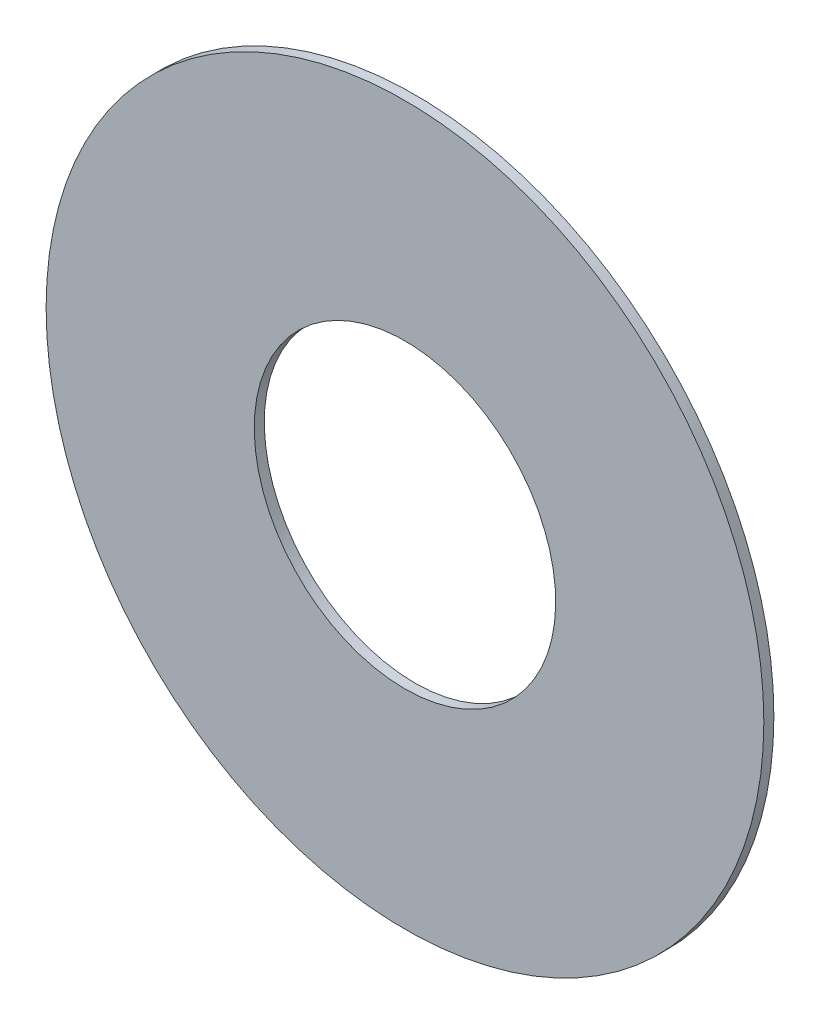
ISO-10303-21;
HEADER;
FILE_DESCRIPTION(('STEP AP214'),'2;1');
FILE_NAME('part.step','',(''),(''),'','','');
FILE_SCHEMA(('AUTOMOTIVE_DESIGN { 1 0 10303 214 1 1 1 1 }'));
ENDSEC;
DATA;
#1=APPLICATION_CONTEXT('core data for automotive mechanical design processes');
#2=APPLICATION_PROTOCOL_DEFINITION('international standard','automotive_design',2000,#1);
#3=PRODUCT_CONTEXT('',#1,'mechanical');
#4=PRODUCT('Part','Part','',(#3));
#5=PRODUCT_RELATED_PRODUCT_CATEGORY('part','',(#4));
#6=PRODUCT_DEFINITION_FORMATION('','',#4);
#7=PRODUCT_DEFINITION_CONTEXT('part definition',#1,'design');
#8=PRODUCT_DEFINITION('design','',#6,#7);
#9=PRODUCT_DEFINITION_SHAPE('','',#8);
#10=(LENGTH_UNIT() NAMED_UNIT(*) SI_UNIT(.MILLI.,.METRE.));
#11=(NAMED_UNIT(*) PLANE_ANGLE_UNIT() SI_UNIT($,.RADIAN.));
#12=(NAMED_UNIT(*) SI_UNIT($,.STERADIAN.) SOLID_ANGLE_UNIT());
#13=UNCERTAINTY_MEASURE_WITH_UNIT(LENGTH_MEASURE(1.E-05),#10,'distance_accuracy_value','');
#14=(GEOMETRIC_REPRESENTATION_CONTEXT(3) GLOBAL_UNCERTAINTY_ASSIGNED_CONTEXT((#13)) GLOBAL_UNIT_ASSIGNED_CONTEXT((#10,
#11,#12)) REPRESENTATION_CONTEXT('',''));
#15=CARTESIAN_POINT('',(0.,0.,0.));
#16=DIRECTION('',(0.,0.,1.));
#17=DIRECTION('',(1.,0.,0.));
#18=AXIS2_PLACEMENT_3D('',#15,#16,#17);
#19=CARTESIAN_POINT('',(154.002,-113.984,-0.045));
#20=DIRECTION('',(0.,0.,-1.));
#21=DIRECTION('',(0.,-1.,0.));
#22=AXIS2_PLACEMENT_3D('',#19,#20,#21);
#23=CYLINDRICAL_SURFACE('',#22,0.525);
#24=CARTESIAN_POINT('',(154.002,-113.984,1.67));
#25=DIRECTION('',(0.,0.,-1.));
#26=DIRECTION('',(0.,-1.,0.));
#27=AXIS2_PLACEMENT_3D('',#24,#25,#26);
#28=CIRCLE('',#27,0.525);
#29=CARTESIAN_POINT('',(154.002,-114.509,1.67));
#30=VERTEX_POINT('',#29);
#31=EDGE_CURVE('E25',#30,#30,#28,.T.);
#32=ORIENTED_EDGE('',*,*,#31,.T.);
#33=DIRECTION('',(0.,0.,1.));
#34=VECTOR('',#33,1.);
#35=CARTESIAN_POINT('',(154.002,-114.509,-0.045));
#36=LINE('',#35,#34);
#37=CARTESIAN_POINT('',(154.002,-114.509,1.705));
#38=VERTEX_POINT('',#37);
#39=EDGE_CURVE('E11',#30,#38,#36,.T.);
#40=ORIENTED_EDGE('',*,*,#39,.T.);
#41=CARTESIAN_POINT('',(154.002,-113.984,1.705));
#42=DIRECTION('',(0.,0.,-1.));
#43=DIRECTION('',(0.,-1.,0.));
#44=AXIS2_PLACEMENT_3D('',#41,#42,#43);
#45=CIRCLE('',#44,0.525);
#46=EDGE_CURVE('E68',#38,#38,#45,.T.);
#47=ORIENTED_EDGE('',*,*,#46,.F.);
#48=ORIENTED_EDGE('',*,*,#39,.F.);
#49=EDGE_LOOP('',(#32,#40,#47,#48));
#50=FACE_BOUND('',#49,.T.);
#51=ADVANCED_FACE('F17',(#50),#23,.F.);
#52=CARTESIAN_POINT('',(154.002,-113.984,1.67));
#53=DIRECTION('',(0.,0.,1.));
#54=DIRECTION('',(1.,0.,0.));
#55=AXIS2_PLACEMENT_3D('',#52,#53,#54);
#56=PLANE('',#55);
#57=ORIENTED_EDGE('',*,*,#31,.F.);
#58=EDGE_LOOP('',(#57));
#59=FACE_BOUND('',#58,.T.);
#60=CARTESIAN_POINT('',(154.002,-113.984,1.67));
#61=DIRECTION('',(0.,0.,1.));
#62=DIRECTION('',(1.,0.,0.));
#63=AXIS2_PLACEMENT_3D('',#60,#61,#62);
#64=CIRCLE('',#63,1.25);
#65=CARTESIAN_POINT('',(155.252,-113.984,1.67));
#66=VERTEX_POINT('',#65);
#67=EDGE_CURVE('E55',#66,#66,#64,.T.);
#68=ORIENTED_EDGE('',*,*,#67,.F.);
#69=EDGE_LOOP('',(#68));
#70=FACE_BOUND('',#69,.T.);
#71=ADVANCED_FACE('F75',(#59,#70),#56,.F.);
#72=CARTESIAN_POINT('',(154.002,-113.984,1.705));
#73=DIRECTION('',(0.,0.,1.));
#74=DIRECTION('',(1.,0.,0.));
#75=AXIS2_PLACEMENT_3D('',#72,#73,#74);
#76=PLANE('',#75);
#77=ORIENTED_EDGE('',*,*,#46,.T.);
#78=EDGE_LOOP('',(#77));
#79=FACE_BOUND('',#78,.T.);
#80=CARTESIAN_POINT('',(154.002,-113.984,1.705));
#81=DIRECTION('',(0.,0.,1.));
#82=DIRECTION('',(1.,0.,0.));
#83=AXIS2_PLACEMENT_3D('',#80,#81,#82);
#84=CIRCLE('',#83,1.25);
#85=CARTESIAN_POINT('',(155.252,-113.984,1.705));
#86=VERTEX_POINT('',#85);
#87=EDGE_CURVE('E53',#86,#86,#84,.T.);
#88=ORIENTED_EDGE('',*,*,#87,.T.);
#89=EDGE_LOOP('',(#88));
#90=FACE_BOUND('',#89,.T.);
#91=ADVANCED_FACE('F59',(#79,#90),#76,.T.);
#92=CARTESIAN_POINT('',(154.002,-113.984,1.67));
#93=DIRECTION('',(0.,0.,1.));
#94=DIRECTION('',(1.,0.,0.));
#95=AXIS2_PLACEMENT_3D('',#92,#93,#94);
#96=CYLINDRICAL_SURFACE('',#95,1.25);
#97=ORIENTED_EDGE('',*,*,#87,.F.);
#98=DIRECTION('',(0.,0.,1.));
#99=VECTOR('',#98,1.);
#100=CARTESIAN_POINT('',(155.252,-113.984,1.67));
#101=LINE('',#100,#99);
#102=EDGE_CURVE('E50',#66,#86,#101,.T.);
#103=ORIENTED_EDGE('',*,*,#102,.F.);
#104=ORIENTED_EDGE('',*,*,#67,.T.);
#105=ORIENTED_EDGE('',*,*,#102,.T.);
#106=EDGE_LOOP('',(#97,#103,#104,#105));
#107=FACE_BOUND('',#106,.T.);
#108=ADVANCED_FACE('F52',(#107),#96,.T.);
#109=CLOSED_SHELL('',(#51,#71,#91,#108));
#110=MANIFOLD_SOLID_BREP('B1',#109);
#111=ADVANCED_BREP_SHAPE_REPRESENTATION('',(#18,#110),#14);
#112=SHAPE_DEFINITION_REPRESENTATION(#9,#111);
ENDSEC;
END-ISO-10303-21;
